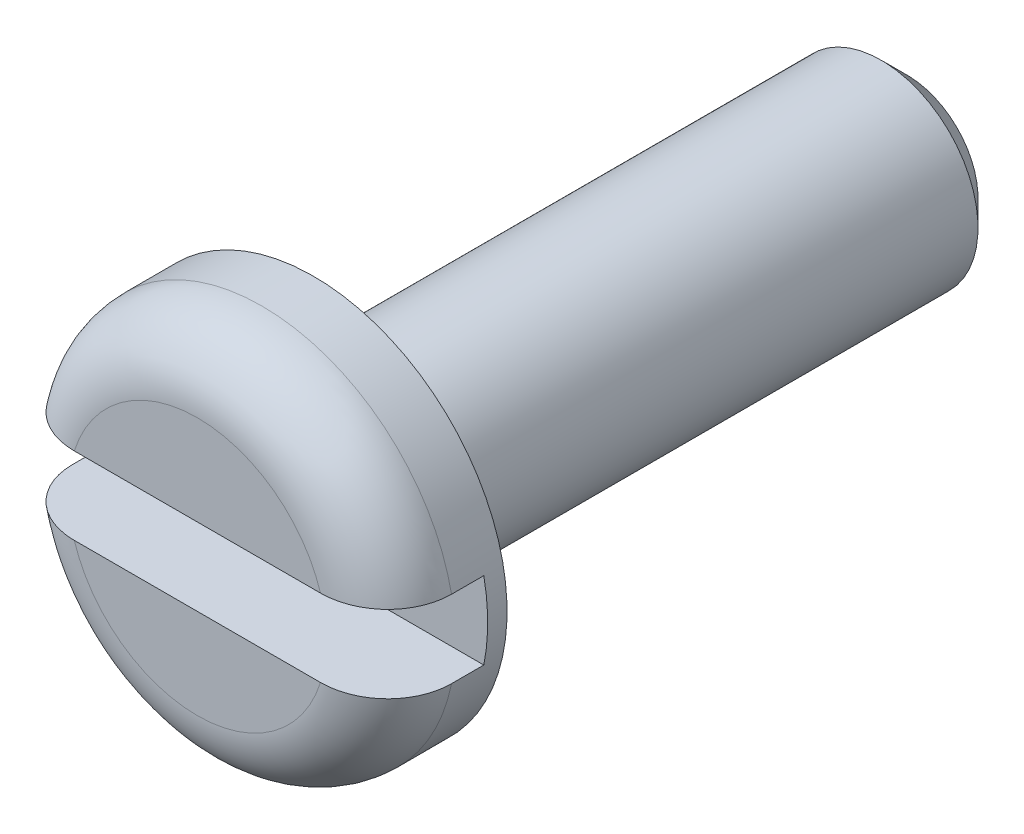
ISO-10303-21;
HEADER;
FILE_DESCRIPTION(('STEP AP214'),'2;1');
FILE_NAME('part.step','',(''),(''),'','','');
FILE_SCHEMA(('AUTOMOTIVE_DESIGN { 1 0 10303 214 1 1 1 1 }'));
ENDSEC;
DATA;
#1=APPLICATION_CONTEXT('core data for automotive mechanical design processes');
#2=APPLICATION_PROTOCOL_DEFINITION('international standard','automotive_design',2000,#1);
#3=PRODUCT_CONTEXT('',#1,'mechanical');
#4=PRODUCT('Part','Part','',(#3));
#5=PRODUCT_RELATED_PRODUCT_CATEGORY('part','',(#4));
#6=PRODUCT_DEFINITION_FORMATION('','',#4);
#7=PRODUCT_DEFINITION_CONTEXT('part definition',#1,'design');
#8=PRODUCT_DEFINITION('design','',#6,#7);
#9=PRODUCT_DEFINITION_SHAPE('','',#8);
#10=(LENGTH_UNIT() NAMED_UNIT(*) SI_UNIT(.MILLI.,.METRE.));
#11=(NAMED_UNIT(*) PLANE_ANGLE_UNIT() SI_UNIT($,.RADIAN.));
#12=(NAMED_UNIT(*) SI_UNIT($,.STERADIAN.) SOLID_ANGLE_UNIT());
#13=UNCERTAINTY_MEASURE_WITH_UNIT(LENGTH_MEASURE(1.E-05),#10,'distance_accuracy_value','');
#14=(GEOMETRIC_REPRESENTATION_CONTEXT(3) GLOBAL_UNCERTAINTY_ASSIGNED_CONTEXT((#13)) GLOBAL_UNIT_ASSIGNED_CONTEXT((#10,
#11,#12)) REPRESENTATION_CONTEXT('',''));
#15=CARTESIAN_POINT('',(0.,0.,0.));
#16=DIRECTION('',(0.,0.,1.));
#17=DIRECTION('',(1.,0.,0.));
#18=AXIS2_PLACEMENT_3D('',#15,#16,#17);
#19=CARTESIAN_POINT('',(0.,0.,0.));
#20=DIRECTION('',(0.,0.,1.));
#21=DIRECTION('',(1.00000000000022,0.,0.));
#22=AXIS2_PLACEMENT_3D('',#19,#20,#21);
#23=PLANE('',#22);
#24=DIRECTION('',(1.00000000000022,0.,0.));
#25=VECTOR('',#24,1.);
#26=CARTESIAN_POINT('',(-3.00000000000242,-0.600000000001349,0.));
#27=LINE('',#26,#25);
#28=CARTESIAN_POINT('',(-1.90787840283495,-0.600000000003181,7.21644966006352E-13));
#29=VERTEX_POINT('',#28);
#30=CARTESIAN_POINT('',(1.90787840283341,-0.600000000006068,-6.38378239159465E-13));
#31=VERTEX_POINT('',#30);
#32=EDGE_CURVE('E138',#29,#31,#27,.T.);
#33=ORIENTED_EDGE('',*,*,#32,.F.);
#34=CARTESIAN_POINT('',(0.,0.,0.));
#35=DIRECTION('',(0.,0.,1.));
#36=DIRECTION('',(1.00000000000022,0.,0.));
#37=AXIS2_PLACEMENT_3D('',#34,#35,#36);
#38=CIRCLE('',#37,2.);
#39=EDGE_CURVE('E154',#29,#31,#38,.T.);
#40=ORIENTED_EDGE('',*,*,#39,.T.);
#41=EDGE_LOOP('',(#33,#40));
#42=FACE_BOUND('',#41,.T.);
#43=ADVANCED_FACE('F48',(#42),#23,.T.);
#44=DIRECTION('',(1.00000000000022,0.,0.));
#45=VECTOR('',#44,1.);
#46=CARTESIAN_POINT('',(-3.00000000000036,0.599999999998768,0.));
#47=LINE('',#46,#45);
#48=CARTESIAN_POINT('',(-1.90787840283528,0.599999999997547,1.13797860024079E-12));
#49=VERTEX_POINT('',#48);
#50=CARTESIAN_POINT('',(1.90787840283402,0.59999999999541,-3.05311331771918E-13));
#51=VERTEX_POINT('',#50);
#52=EDGE_CURVE('E120',#49,#51,#47,.T.);
#53=ORIENTED_EDGE('',*,*,#52,.T.);
#54=CARTESIAN_POINT('',(0.,0.,0.));
#55=DIRECTION('',(0.,0.,1.));
#56=DIRECTION('',(1.00000000000022,0.,0.));
#57=AXIS2_PLACEMENT_3D('',#54,#55,#56);
#58=CIRCLE('',#57,2.);
#59=EDGE_CURVE('E69',#51,#49,#58,.T.);
#60=ORIENTED_EDGE('',*,*,#59,.T.);
#61=EDGE_LOOP('',(#53,#60));
#62=FACE_BOUND('',#61,.T.);
#63=ADVANCED_FACE('F202',(#62),#23,.T.);
#64=CARTESIAN_POINT('',(-2.15105711021124E-12,-2.66453525910038E-12,-11.));
#65=DIRECTION('',(0.,0.,-1.));
#66=DIRECTION('',(-1.00000000000022,0.,0.));
#67=AXIS2_PLACEMENT_3D('',#64,#65,#66);
#68=CYLINDRICAL_SURFACE('',#67,3.);
#69=DIRECTION('',(0.,0.,-1.));
#70=VECTOR('',#69,1.);
#71=CARTESIAN_POINT('',(2.93938769133775,-0.600000000005957,-11.));
#72=LINE('',#71,#70);
#73=CARTESIAN_POINT('',(2.93938769134063,-0.600000000002293,-1.));
#74=VERTEX_POINT('',#73);
#75=CARTESIAN_POINT('',(2.93938769133843,-0.600000000002848,-1.5));
#76=VERTEX_POINT('',#75);
#77=EDGE_CURVE('E111',#74,#76,#72,.T.);
#78=ORIENTED_EDGE('',*,*,#77,.F.);
#79=CARTESIAN_POINT('',(2.63677968348475E-13,0.,-1.));
#80=DIRECTION('',(0.,0.,1.));
#81=DIRECTION('',(1.00000000000022,0.,0.));
#82=AXIS2_PLACEMENT_3D('',#79,#80,#81);
#83=CIRCLE('',#82,3.);
#84=CARTESIAN_POINT('',(-2.93938769134018,-0.600000000001044,-1.));
#85=VERTEX_POINT('',#84);
#86=EDGE_CURVE('E155',#74,#85,#83,.F.);
#87=ORIENTED_EDGE('',*,*,#86,.T.);
#88=DIRECTION('',(0.,0.,-1.));
#89=VECTOR('',#88,1.);
#90=CARTESIAN_POINT('',(-2.93938769134275,-0.600000000001794,-11.));
#91=LINE('',#90,#89);
#92=CARTESIAN_POINT('',(-2.93938769134187,-0.600000000001488,-1.5));
#93=VERTEX_POINT('',#92);
#94=EDGE_CURVE('E128',#93,#85,#91,.F.);
#95=ORIENTED_EDGE('',*,*,#94,.F.);
#96=CARTESIAN_POINT('',(0.,0.,-1.5));
#97=DIRECTION('',(0.,0.,-1.));
#98=DIRECTION('',(-1.00000000000022,0.,0.));
#99=AXIS2_PLACEMENT_3D('',#96,#97,#98);
#100=CIRCLE('',#99,3.);
#101=CARTESIAN_POINT('',(-2.93938769133992,0.599999999999795,-1.5));
#102=VERTEX_POINT('',#101);
#103=EDGE_CURVE('E112',#102,#93,#100,.F.);
#104=ORIENTED_EDGE('',*,*,#103,.F.);
#105=DIRECTION('',(0.,0.,-1.));
#106=VECTOR('',#105,1.);
#107=CARTESIAN_POINT('',(-2.9393876913428,0.599999999998907,-11.));
#108=LINE('',#107,#106);
#109=CARTESIAN_POINT('',(-2.93938769134051,0.599999999998518,-1.));
#110=VERTEX_POINT('',#109);
#111=EDGE_CURVE('E100',#110,#102,#108,.T.);
#112=ORIENTED_EDGE('',*,*,#111,.F.);
#113=CARTESIAN_POINT('',(2.63677968348475E-13,0.,-1.));
#114=DIRECTION('',(0.,0.,1.));
#115=DIRECTION('',(1.00000000000022,0.,0.));
#116=AXIS2_PLACEMENT_3D('',#113,#114,#115);
#117=CIRCLE('',#116,3.);
#118=CARTESIAN_POINT('',(2.93938769134075,0.59999999999763,-0.999999999999973));
#119=VERTEX_POINT('',#118);
#120=EDGE_CURVE('E158',#110,#119,#117,.F.);
#121=ORIENTED_EDGE('',*,*,#120,.T.);
#122=DIRECTION('',(0.,0.,-1.));
#123=VECTOR('',#122,1.);
#124=CARTESIAN_POINT('',(2.93938769134014,0.599999999994827,-11.));
#125=LINE('',#124,#123);
#126=CARTESIAN_POINT('',(2.93938769134153,0.599999999997575,-1.49999999999997));
#127=VERTEX_POINT('',#126);
#128=EDGE_CURVE('E129',#127,#119,#125,.F.);
#129=ORIENTED_EDGE('',*,*,#128,.F.);
#130=EDGE_CURVE('E119',#76,#127,#100,.F.);
#131=ORIENTED_EDGE('',*,*,#130,.F.);
#132=EDGE_LOOP('',(#78,#87,#95,#104,#112,#121,#129,#131));
#133=FACE_BOUND('',#132,.T.);
#134=CARTESIAN_POINT('',(-2.35922392732846E-13,0.,-1.8));
#135=DIRECTION('',(0.,0.,-1.));
#136=DIRECTION('',(-1.00000000000022,0.,0.));
#137=AXIS2_PLACEMENT_3D('',#134,#135,#136);
#138=CIRCLE('',#137,3.);
#139=CARTESIAN_POINT('',(-3.00000000000089,0.,-1.8));
#140=VERTEX_POINT('',#139);
#141=EDGE_CURVE('E133',#140,#140,#138,.T.);
#142=ORIENTED_EDGE('',*,*,#141,.F.);
#143=EDGE_LOOP('',(#142));
#144=FACE_BOUND('',#143,.T.);
#145=ADVANCED_FACE('F124',(#133,#144),#68,.T.);
#146=CARTESIAN_POINT('',(-3.00000000000132,-9.99200722162641E-13,-1.79999999999997));
#147=DIRECTION('',(0.,0.,-1.));
#148=DIRECTION('',(-1.00000000000022,0.,0.));
#149=AXIS2_PLACEMENT_3D('',#146,#147,#148);
#150=PLANE('',#149);
#151=CARTESIAN_POINT('',(-2.35922392732846E-13,0.,-1.8));
#152=DIRECTION('',(0.,0.,-1.));
#153=DIRECTION('',(-1.00000000000022,0.,0.));
#154=AXIS2_PLACEMENT_3D('',#151,#152,#153);
#155=CIRCLE('',#154,1.9);
#156=CARTESIAN_POINT('',(-1.90000000000065,0.,-1.8));
#157=VERTEX_POINT('',#156);
#158=EDGE_CURVE('E13',#157,#157,#155,.F.);
#159=ORIENTED_EDGE('',*,*,#158,.T.);
#160=EDGE_LOOP('',(#159));
#161=FACE_BOUND('',#160,.T.);
#162=ORIENTED_EDGE('',*,*,#141,.T.);
#163=EDGE_LOOP('',(#162));
#164=FACE_BOUND('',#163,.T.);
#165=ADVANCED_FACE('F233',(#161,#164),#150,.T.);
#166=CARTESIAN_POINT('',(-2.15105711021124E-12,-2.66453525910038E-12,-11.));
#167=DIRECTION('',(0.,0.,-1.));
#168=DIRECTION('',(-1.00000000000022,0.,0.));
#169=AXIS2_PLACEMENT_3D('',#166,#167,#168);
#170=CYLINDRICAL_SURFACE('',#169,1.5);
#171=CARTESIAN_POINT('',(0.,-1.94289029309402E-13,-2.20000000000001));
#172=DIRECTION('',(0.,0.,-1.));
#173=DIRECTION('',(-1.00000000000022,0.,0.));
#174=AXIS2_PLACEMENT_3D('',#171,#172,#173);
#175=CIRCLE('',#174,1.5);
#176=CARTESIAN_POINT('',(-1.50000000000028,-1.96453964207421E-13,-2.20000000000001));
#177=VERTEX_POINT('',#176);
#178=EDGE_CURVE('E56',#177,#177,#175,.T.);
#179=ORIENTED_EDGE('',*,*,#178,.T.);
#180=EDGE_LOOP('',(#179));
#181=FACE_BOUND('',#180,.T.);
#182=CARTESIAN_POINT('',(-1.24894669259468E-12,-3.33066907387547E-13,-10.6));
#183=DIRECTION('',(0.,0.,-1.));
#184=DIRECTION('',(-1.00000000000022,0.,0.));
#185=AXIS2_PLACEMENT_3D('',#182,#183,#184);
#186=CIRCLE('',#185,1.5);
#187=CARTESIAN_POINT('',(-1.50000000000158,-3.35231842285566E-13,-10.6));
#188=VERTEX_POINT('',#187);
#189=EDGE_CURVE('E216',#188,#188,#186,.F.);
#190=ORIENTED_EDGE('',*,*,#189,.T.);
#191=EDGE_LOOP('',(#190));
#192=FACE_BOUND('',#191,.T.);
#193=ADVANCED_FACE('F228',(#181,#192),#170,.T.);
#194=CARTESIAN_POINT('',(-1.50000000000131,-3.94129173741931E-12,-11.));
#195=DIRECTION('',(0.,0.,-1.));
#196=DIRECTION('',(-1.00000000000022,0.,0.));
#197=AXIS2_PLACEMENT_3D('',#194,#195,#196);
#198=PLANE('',#197);
#199=CARTESIAN_POINT('',(-2.15105711021124E-12,-2.66453525910038E-12,-11.));
#200=DIRECTION('',(0.,0.,-1.));
#201=DIRECTION('',(-1.00000000000022,0.,0.));
#202=AXIS2_PLACEMENT_3D('',#199,#200,#201);
#203=CIRCLE('',#202,1.1);
#204=CARTESIAN_POINT('',(-1.10000000000239,-2.66612287802559E-12,-11.));
#205=VERTEX_POINT('',#204);
#206=EDGE_CURVE('E219',#205,#205,#203,.T.);
#207=ORIENTED_EDGE('',*,*,#206,.T.);
#208=EDGE_LOOP('',(#207));
#209=FACE_BOUND('',#208,.T.);
#210=ADVANCED_FACE('F232',(#209),#198,.T.);
#211=CARTESIAN_POINT('',(-2.99999999999979,0.599999999999268,-1.5));
#212=DIRECTION('',(0.,0.,-1.));
#213=DIRECTION('',(-1.00000000000022,0.,0.));
#214=AXIS2_PLACEMENT_3D('',#211,#212,#213);
#215=PLANE('',#214);
#216=DIRECTION('',(1.00000000000022,0.,0.));
#217=VECTOR('',#216,1.);
#218=CARTESIAN_POINT('',(-3.00000000000324,-0.6000000000011,-1.5));
#219=LINE('',#218,#217);
#220=EDGE_CURVE('E135',#93,#76,#219,.T.);
#221=ORIENTED_EDGE('',*,*,#220,.T.);
#222=ORIENTED_EDGE('',*,*,#130,.T.);
#223=DIRECTION('',(1.00000000000022,0.,0.));
#224=VECTOR('',#223,1.);
#225=CARTESIAN_POINT('',(-2.99999999999979,0.599999999999268,-1.5));
#226=LINE('',#225,#224);
#227=EDGE_CURVE('E103',#102,#127,#226,.T.);
#228=ORIENTED_EDGE('',*,*,#227,.F.);
#229=ORIENTED_EDGE('',*,*,#103,.T.);
#230=EDGE_LOOP('',(#221,#222,#228,#229));
#231=FACE_BOUND('',#230,.T.);
#232=ADVANCED_FACE('F116',(#231),#215,.F.);
#233=CARTESIAN_POINT('',(-3.00000000000242,-0.600000000001349,0.));
#234=DIRECTION('',(0.,-1.00000000000014,0.));
#235=DIRECTION('',(0.,0.,-1.));
#236=AXIS2_PLACEMENT_3D('',#233,#234,#235);
#237=PLANE('',#236);
#238=ORIENTED_EDGE('',*,*,#94,.T.);
#239=CARTESIAN_POINT('',(-2.93938769134018,-0.600000000001044,-1.));
#240=CARTESIAN_POINT('',(-2.9393877027678,-0.600000000001185,-0.972321638172671));
#241=CARTESIAN_POINT('',(-2.93821410236492,-0.600000000001293,-0.944656636253674));
#242=CARTESIAN_POINT('',(-2.9335334943145,-0.600000000001406,-0.889526861951873));
#243=CARTESIAN_POINT('',(-2.9300266636617,-0.600000000001412,-0.8620620745409));
#244=CARTESIAN_POINT('',(-2.91604632548926,-0.600000000001225,-0.780336207940272));
#245=CARTESIAN_POINT('',(-2.90211283648314,-0.60000000000083,-0.726626269473739));
#246=CARTESIAN_POINT('',(-2.8654375113333,-0.60000000000087,-0.622315882639271));
#247=CARTESIAN_POINT('',(-2.8426926651567,-0.600000000001305,-0.571716503715835));
#248=CARTESIAN_POINT('',(-2.7890851125262,-0.600000000001393,-0.475017339732733));
#249=CARTESIAN_POINT('',(-2.75822276982445,-0.600000000001046,-0.428917353178228));
#250=CARTESIAN_POINT('',(-2.68907078439243,-0.600000000000597,-0.342172235650302));
#251=CARTESIAN_POINT('',(-2.6507328609371,-0.600000000000496,-0.301565637862794));
#252=CARTESIAN_POINT('',(-2.56789366745141,-0.600000000002203,-0.227220078448313));
#253=CARTESIAN_POINT('',(-2.52339168994,-0.600000000004012,-0.193481906246182));
#254=CARTESIAN_POINT('',(-2.4286108479415,-0.600000000003232,-0.133118586778698));
#255=CARTESIAN_POINT('',(-2.37823822200297,-0.600000000000559,-0.106640901724631));
#256=CARTESIAN_POINT('',(-2.27384844267121,-0.600000000002139,-0.0622394746545549));
#257=CARTESIAN_POINT('',(-2.21983105484881,-0.600000000006391,-0.0443162834588428));
#258=CARTESIAN_POINT('',(-2.12272739795919,-0.600000000005919,-0.0205271433834775));
#259=CARTESIAN_POINT('',(-2.08008208035819,-0.600000000003081,-0.0128109577037055));
#260=CARTESIAN_POINT('',(-1.99425117998572,-0.599999999999619,-0.00254656462243522));
#261=CARTESIAN_POINT('',(-1.95106672026119,-0.599999999998991,1.10118976953279E-05));
#262=CARTESIAN_POINT('',(-1.90787840283495,-0.600000000003181,7.21644966006352E-13));
#263=B_SPLINE_CURVE_WITH_KNOTS('',3,(#239,#240,#241,#242,#243,#244,#245,#246,#247,#248,#249,
#250,#251,#252,#253,#254,#255,#256,#257,#258,#259,#260,#261,#262),.UNSPECIFIED.,.F.,.F.,(4,2,2,
2,2,2,2,2,2,2,2,4),(0.,0.0829837302468657,0.165961166211278,0.331568485714643,0.497232428012235,
0.662888948027619,0.829653081162648,0.996436370582572,1.16639122945774,1.33635703017967,
1.46606963518796,1.5955464419338),.UNSPECIFIED.);
#264=EDGE_CURVE('E148',#85,#29,#263,.T.);
#265=ORIENTED_EDGE('',*,*,#264,.T.);
#266=ORIENTED_EDGE('',*,*,#32,.T.);
#267=CARTESIAN_POINT('',(1.90787840283341,-0.600000000006068,-6.38378239159465E-13));
#268=CARTESIAN_POINT('',(1.93773529066253,-0.600000000003278,-2.47549040859226E-07));
#269=CARTESIAN_POINT('',(1.96758017570203,-0.600000000001918,-0.00121770334637381));
#270=CARTESIAN_POINT('',(2.02707319186645,-0.600000000000774,-0.00610610499448331));
#271=CARTESIAN_POINT('',(2.05672128723209,-0.600000000000988,-0.00977748506088703));
#272=CARTESIAN_POINT('',(2.1450883845687,-0.600000000002061,-0.0244993421219332));
#273=CARTESIAN_POINT('',(2.20323726850195,-0.600000000003348,-0.0392575272750372));
#274=CARTESIAN_POINT('',(2.31624809768403,-0.600000000003292,-0.078479894594628));
#275=CARTESIAN_POINT('',(2.37110469866018,-0.600000000001947,-0.102959391387295));
#276=CARTESIAN_POINT('',(2.47571188316485,-0.600000000000746,-0.161057784490168));
#277=CARTESIAN_POINT('',(2.52546640218061,-0.600000000000889,-0.194669562459306));
#278=CARTESIAN_POINT('',(2.61684428964099,-0.600000000000976,-0.268970846938526));
#279=CARTESIAN_POINT('',(2.65867082350479,-0.600000000000925,-0.309410609137779));
#280=CARTESIAN_POINT('',(2.73471620677981,-0.600000000001766,-0.396932843703567));
#281=CARTESIAN_POINT('',(2.76893342699564,-0.600000000002659,-0.444016735093798));
#282=CARTESIAN_POINT('',(2.82779584490271,-0.600000000002102,-0.542047078322682));
#283=CARTESIAN_POINT('',(2.85267997210012,-0.600000000000716,-0.592850377348792));
#284=CARTESIAN_POINT('',(2.89338734810302,-0.600000000001974,-0.697941697102589));
#285=CARTESIAN_POINT('',(2.90921915700912,-0.600000000004614,-0.752226371536743));
#286=CARTESIAN_POINT('',(2.92663542181765,-0.600000000003625,-0.839129838729036));
#287=CARTESIAN_POINT('',(2.93141571310184,-0.600000000002186,-0.871141118720788));
#288=CARTESIAN_POINT('',(2.93779035512899,-0.600000000000507,-0.935429884254512));
#289=CARTESIAN_POINT('',(2.93938956207142,-0.600000000000266,-0.96770688838184));
#290=CARTESIAN_POINT('',(2.93938769134063,-0.600000000002293,-1.));
#291=B_SPLINE_CURVE_WITH_KNOTS('',3,(#267,#268,#269,#270,#271,#272,#273,#274,#275,#276,#277,
#278,#279,#280,#281,#282,#283,#284,#285,#286,#287,#288,#289,#290),.UNSPECIFIED.,.F.,.F.,(4,2,2,
2,2,2,2,2,2,2,2,4),(0.,0.0895205676365748,0.179056979903786,0.35810885401556,0.537443926549588,
0.716639611791516,0.890318718479864,1.06403497508301,1.23293840849273,1.40168185727621,
1.49863809906697,1.59544621485526),.UNSPECIFIED.);
#292=EDGE_CURVE('E147',#31,#74,#291,.T.);
#293=ORIENTED_EDGE('',*,*,#292,.T.);
#294=ORIENTED_EDGE('',*,*,#77,.T.);
#295=ORIENTED_EDGE('',*,*,#220,.F.);
#296=EDGE_LOOP('',(#238,#265,#266,#293,#294,#295));
#297=FACE_BOUND('',#296,.T.);
#298=ADVANCED_FACE('F146',(#297),#237,.F.);
#299=CARTESIAN_POINT('',(-3.00000000000036,0.599999999998768,0.));
#300=DIRECTION('',(0.,1.00000000000014,0.));
#301=DIRECTION('',(0.,0.,1.));
#302=AXIS2_PLACEMENT_3D('',#299,#300,#301);
#303=PLANE('',#302);
#304=ORIENTED_EDGE('',*,*,#128,.T.);
#305=CARTESIAN_POINT('',(2.93938769134075,0.59999999999763,-0.999999999999973));
#306=CARTESIAN_POINT('',(2.9393877027684,0.599999999998122,-0.972321638172503));
#307=CARTESIAN_POINT('',(2.93821410236577,0.599999999998542,-0.944656636253235));
#308=CARTESIAN_POINT('',(2.93353349431568,0.599999999999002,-0.889526861951136));
#309=CARTESIAN_POINT('',(2.93002666366297,0.599999999999041,-0.862062074540136));
#310=CARTESIAN_POINT('',(2.91604632548957,0.599999999998235,-0.780336207939778));
#311=CARTESIAN_POINT('',(2.90211283648116,0.59999999999647,-0.72662626947396));
#312=CARTESIAN_POINT('',(2.8654375113314,0.599999999996515,-0.622315882638835));
#313=CARTESIAN_POINT('',(2.84269266515714,0.599999999998327,-0.571716503714035));
#314=CARTESIAN_POINT('',(2.78908511252606,0.599999999999217,-0.47501733973116));
#315=CARTESIAN_POINT('',(2.75822276982136,0.599999999998296,-0.428917353178254));
#316=CARTESIAN_POINT('',(2.68907078438863,0.599999999997907,-0.342172235650563));
#317=CARTESIAN_POINT('',(2.65073286093568,0.599999999998449,-0.301565637861592));
#318=CARTESIAN_POINT('',(2.567893667452,0.599999999999095,-0.22722007844674));
#319=CARTESIAN_POINT('',(2.52339168994026,0.599999999999199,-0.19348190624569));
#320=CARTESIAN_POINT('',(2.42861084794163,0.599999999999506,-0.133118586778734));
#321=CARTESIAN_POINT('',(2.37823822200328,0.599999999999712,-0.106640901724184));
#322=CARTESIAN_POINT('',(2.27384844267127,0.599999999997831,-0.06223947465413));
#323=CARTESIAN_POINT('',(2.21983105484844,0.599999999995743,-0.0443162834589384));
#324=CARTESIAN_POINT('',(2.12272739795842,0.599999999996379,-0.0205271433835684));
#325=CARTESIAN_POINT('',(2.08008208035738,0.599999999998079,-0.0128109577034852));
#326=CARTESIAN_POINT('',(1.99425117998489,0.599999999999463,-0.00254656462214918));
#327=CARTESIAN_POINT('',(1.95106672026038,0.599999999999149,1.10118977487419E-05));
#328=CARTESIAN_POINT('',(1.90787840283402,0.59999999999541,-3.05311331771918E-13));
#329=B_SPLINE_CURVE_WITH_KNOTS('',3,(#305,#306,#307,#308,#309,#310,#311,#312,#313,#314,#315,
#316,#317,#318,#319,#320,#321,#322,#323,#324,#325,#326,#327,#328),.UNSPECIFIED.,.F.,.F.,(4,2,2,
2,2,2,2,2,2,2,2,4),(0.,0.0829837302475245,0.165961166211888,0.331568485715372,0.497232428013587,
0.662888948029848,0.829653081163602,0.996436370581969,1.16639122945753,1.33635703018011,
1.46606963518869,1.59554644193452),.UNSPECIFIED.);
#330=EDGE_CURVE('E63',#119,#51,#329,.T.);
#331=ORIENTED_EDGE('',*,*,#330,.T.);
#332=ORIENTED_EDGE('',*,*,#52,.F.);
#333=CARTESIAN_POINT('',(-1.90787840283528,0.599999999997547,1.13797860024079E-12));
#334=CARTESIAN_POINT('',(-1.93773529066428,0.599999999997824,-2.47548453212147E-07));
#335=CARTESIAN_POINT('',(-1.96758017570369,0.599999999998398,-0.00121770334628479));
#336=CARTESIAN_POINT('',(-2.02707319186797,0.599999999999139,-0.00610610499479129));
#337=CARTESIAN_POINT('',(-2.05672128723357,0.599999999999306,-0.0097774850610944));
#338=CARTESIAN_POINT('',(-2.14508838456999,0.599999999997694,-0.0244993421221107));
#339=CARTESIAN_POINT('',(-2.20323726850308,0.599999999993805,-0.0392575272755572));
#340=CARTESIAN_POINT('',(-2.31624809768498,0.599999999993684,-0.0784798945953593));
#341=CARTESIAN_POINT('',(-2.37110469866112,0.599999999997464,-0.102959391387908));
#342=CARTESIAN_POINT('',(-2.47571188316595,0.600000000000072,-0.161057784490547));
#343=CARTESIAN_POINT('',(-2.52546640218186,0.599999999998903,-0.194669562459571));
#344=CARTESIAN_POINT('',(-2.61684428964193,0.599999999998201,-0.268970846939128));
#345=CARTESIAN_POINT('',(-2.65867082350527,0.599999999998618,-0.309410609138823));
#346=CARTESIAN_POINT('',(-2.73471620678101,0.599999999998919,-0.396932843704326));
#347=CARTESIAN_POINT('',(-2.76893342699802,0.599999999998803,-0.444016735093826));
#348=CARTESIAN_POINT('',(-2.82779584490466,0.599999999998625,-0.542047078322618));
#349=CARTESIAN_POINT('',(-2.85267997210056,0.599999999998563,-0.592850377349313));
#350=CARTESIAN_POINT('',(-2.89338734810306,0.599999999998974,-0.697941697103212));
#351=CARTESIAN_POINT('',(-2.90921915701025,0.599999999999447,-0.752226371536887));
#352=CARTESIAN_POINT('',(-2.92663542181854,0.599999999999252,-0.839129838729002));
#353=CARTESIAN_POINT('',(-2.93141571310223,0.599999999998985,-0.871141118720832));
#354=CARTESIAN_POINT('',(-2.93779035512864,0.599999999998552,-0.935429884254646));
#355=CARTESIAN_POINT('',(-2.93938956207084,0.599999999998386,-0.967706888381986));
#356=CARTESIAN_POINT('',(-2.93938769134051,0.599999999998518,-1.));
#357=B_SPLINE_CURVE_WITH_KNOTS('',3,(#333,#334,#335,#336,#337,#338,#339,#340,#341,#342,#343,
#344,#345,#346,#347,#348,#349,#350,#351,#352,#353,#354,#355,#356),.UNSPECIFIED.,.F.,.F.,(4,2,2,
2,2,2,2,2,2,2,2,4),(0.,0.0895205676363674,0.179056979903411,0.358108854014891,0.537443926548881,
0.716639611790814,0.890318718479351,1.0640349750826,1.23293840849191,1.40168185727505,
1.49863809906578,1.59544621485396),.UNSPECIFIED.);
#358=EDGE_CURVE('E106',#49,#110,#357,.T.);
#359=ORIENTED_EDGE('',*,*,#358,.T.);
#360=ORIENTED_EDGE('',*,*,#111,.T.);
#361=ORIENTED_EDGE('',*,*,#227,.T.);
#362=EDGE_LOOP('',(#304,#331,#332,#359,#360,#361));
#363=FACE_BOUND('',#362,.T.);
#364=ADVANCED_FACE('F102',(#363),#303,.F.);
#365=CARTESIAN_POINT('',(-2.15105711021124E-12,-2.66453525910038E-12,-11.));
#366=DIRECTION('',(0.,0.,1.));
#367=DIRECTION('',(1.00000000000022,0.,0.));
#368=AXIS2_PLACEMENT_3D('',#365,#366,#367);
#369=CONICAL_SURFACE('',#368,1.1,0.785398163397449);
#370=ORIENTED_EDGE('',*,*,#189,.F.);
#371=EDGE_LOOP('',(#370));
#372=FACE_BOUND('',#371,.T.);
#373=ORIENTED_EDGE('',*,*,#206,.F.);
#374=EDGE_LOOP('',(#373));
#375=FACE_BOUND('',#374,.T.);
#376=ADVANCED_FACE('F179',(#372,#375),#369,.T.);
#377=CARTESIAN_POINT('',(2.63677968348475E-13,0.,-1.));
#378=DIRECTION('',(0.,0.,1.));
#379=DIRECTION('',(1.00000000000022,0.,0.));
#380=AXIS2_PLACEMENT_3D('',#377,#378,#379);
#381=TOROIDAL_SURFACE('',#380,2.,1.);
#382=ORIENTED_EDGE('',*,*,#292,.F.);
#383=ORIENTED_EDGE('',*,*,#39,.F.);
#384=ORIENTED_EDGE('',*,*,#264,.F.);
#385=ORIENTED_EDGE('',*,*,#86,.F.);
#386=EDGE_LOOP('',(#382,#383,#384,#385));
#387=FACE_BOUND('',#386,.T.);
#388=ADVANCED_FACE('F153',(#387),#381,.T.);
#389=CARTESIAN_POINT('',(2.63677968348475E-13,0.,-1.));
#390=DIRECTION('',(0.,0.,1.));
#391=DIRECTION('',(1.00000000000022,0.,0.));
#392=AXIS2_PLACEMENT_3D('',#389,#390,#391);
#393=TOROIDAL_SURFACE('',#392,2.,1.);
#394=ORIENTED_EDGE('',*,*,#358,.F.);
#395=ORIENTED_EDGE('',*,*,#59,.F.);
#396=ORIENTED_EDGE('',*,*,#330,.F.);
#397=ORIENTED_EDGE('',*,*,#120,.F.);
#398=EDGE_LOOP('',(#394,#395,#396,#397));
#399=FACE_BOUND('',#398,.T.);
#400=ADVANCED_FACE('F191',(#399),#393,.T.);
#401=CARTESIAN_POINT('',(0.,-1.94289029309402E-13,-2.20000000000001));
#402=DIRECTION('',(0.,0.,-1.));
#403=DIRECTION('',(-1.00000000000022,0.,0.));
#404=AXIS2_PLACEMENT_3D('',#401,#402,#403);
#405=TOROIDAL_SURFACE('',#404,1.9,0.4);
#406=ORIENTED_EDGE('',*,*,#158,.F.);
#407=EDGE_LOOP('',(#406));
#408=FACE_BOUND('',#407,.T.);
#409=ORIENTED_EDGE('',*,*,#178,.F.);
#410=EDGE_LOOP('',(#409));
#411=FACE_BOUND('',#410,.T.);
#412=ADVANCED_FACE('F50',(#408,#411),#405,.F.);
#413=CLOSED_SHELL('',(#43,#63,#145,#165,#193,#210,#232,#298,#364,#376,#388,#400,#412));
#414=MANIFOLD_SOLID_BREP('B2',#413);
#415=ADVANCED_BREP_SHAPE_REPRESENTATION('',(#18,#414),#14);
#416=SHAPE_DEFINITION_REPRESENTATION(#9,#415);
ENDSEC;
END-ISO-10303-21;
